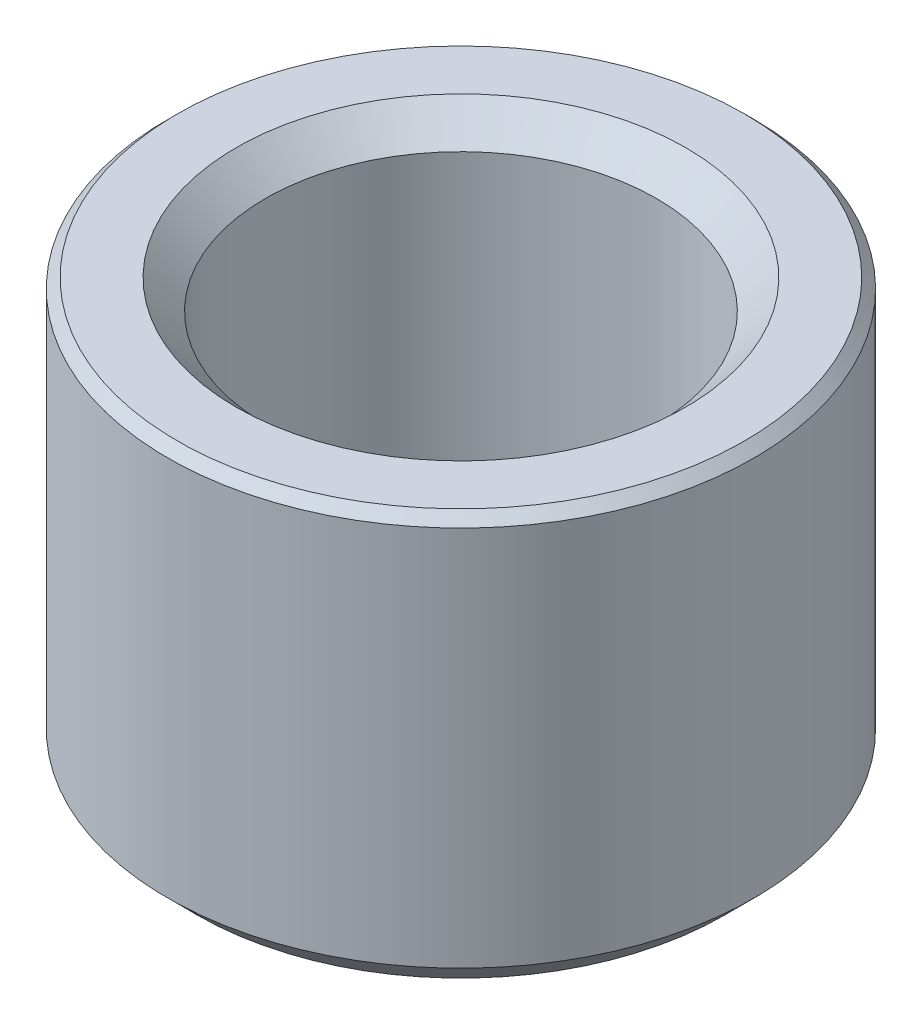
ISO-10303-21;
HEADER;
FILE_DESCRIPTION(('STEP AP214'),'2;1');
FILE_NAME('part.step','',(''),(''),'','','');
FILE_SCHEMA(('AUTOMOTIVE_DESIGN { 1 0 10303 214 1 1 1 1 }'));
ENDSEC;
DATA;
#1=APPLICATION_CONTEXT('core data for automotive mechanical design processes');
#2=APPLICATION_PROTOCOL_DEFINITION('international standard','automotive_design',2000,#1);
#3=PRODUCT_CONTEXT('',#1,'mechanical');
#4=PRODUCT('Part','Part','',(#3));
#5=PRODUCT_RELATED_PRODUCT_CATEGORY('part','',(#4));
#6=PRODUCT_DEFINITION_FORMATION('','',#4);
#7=PRODUCT_DEFINITION_CONTEXT('part definition',#1,'design');
#8=PRODUCT_DEFINITION('design','',#6,#7);
#9=PRODUCT_DEFINITION_SHAPE('','',#8);
#10=(LENGTH_UNIT() NAMED_UNIT(*) SI_UNIT(.MILLI.,.METRE.));
#11=(NAMED_UNIT(*) PLANE_ANGLE_UNIT() SI_UNIT($,.RADIAN.));
#12=(NAMED_UNIT(*) SI_UNIT($,.STERADIAN.) SOLID_ANGLE_UNIT());
#13=UNCERTAINTY_MEASURE_WITH_UNIT(LENGTH_MEASURE(1.E-05),#10,'distance_accuracy_value','');
#14=(GEOMETRIC_REPRESENTATION_CONTEXT(3) GLOBAL_UNCERTAINTY_ASSIGNED_CONTEXT((#13)) GLOBAL_UNIT_ASSIGNED_CONTEXT((#10,
#11,#12)) REPRESENTATION_CONTEXT('',''));
#15=CARTESIAN_POINT('',(0.,0.,0.));
#16=DIRECTION('',(0.,0.,1.));
#17=DIRECTION('',(1.,0.,0.));
#18=AXIS2_PLACEMENT_3D('',#15,#16,#17);
#19=CARTESIAN_POINT('',(0.,0.149999999999999,0.));
#20=DIRECTION('',(0.,1.,0.));
#21=DIRECTION('',(0.,0.,1.));
#22=AXIS2_PLACEMENT_3D('',#19,#20,#21);
#23=CONICAL_SURFACE('',#22,1.5,0.78539816339745);
#24=CARTESIAN_POINT('',(0.,0.,0.));
#25=DIRECTION('',(0.,-1.,0.));
#26=DIRECTION('',(0.,0.,-1.));
#27=AXIS2_PLACEMENT_3D('',#24,#25,#26);
#28=CIRCLE('',#27,1.35);
#29=CARTESIAN_POINT('',(0.,0.,-1.35));
#30=VERTEX_POINT('',#29);
#31=EDGE_CURVE('E10',#30,#30,#28,.T.);
#32=ORIENTED_EDGE('',*,*,#31,.F.);
#33=EDGE_LOOP('',(#32));
#34=FACE_BOUND('',#33,.T.);
#35=CARTESIAN_POINT('',(0.,0.149999999999999,0.));
#36=DIRECTION('',(0.,-1.,0.));
#37=DIRECTION('',(0.,0.,-1.));
#38=AXIS2_PLACEMENT_3D('',#35,#36,#37);
#39=CIRCLE('',#38,1.5);
#40=CARTESIAN_POINT('',(0.,0.149999999999999,-1.5));
#41=VERTEX_POINT('',#40);
#42=EDGE_CURVE('E82',#41,#41,#39,.T.);
#43=ORIENTED_EDGE('',*,*,#42,.T.);
#44=EDGE_LOOP('',(#43));
#45=FACE_BOUND('',#44,.T.);
#46=ADVANCED_FACE('F43',(#34,#45),#23,.T.);
#47=CARTESIAN_POINT('',(-1.35,0.,0.));
#48=DIRECTION('',(0.,1.,0.));
#49=DIRECTION('',(0.,0.,1.));
#50=AXIS2_PLACEMENT_3D('',#47,#48,#49);
#51=PLANE('',#50);
#52=CARTESIAN_POINT('',(0.,0.,0.));
#53=DIRECTION('',(0.,-1.,0.));
#54=DIRECTION('',(0.,0.,-1.));
#55=AXIS2_PLACEMENT_3D('',#52,#53,#54);
#56=CIRCLE('',#55,0.649999999999999);
#57=CARTESIAN_POINT('',(0.,0.,-0.649999999999999));
#58=VERTEX_POINT('',#57);
#59=EDGE_CURVE('E50',#58,#58,#56,.T.);
#60=ORIENTED_EDGE('',*,*,#59,.F.);
#61=EDGE_LOOP('',(#60));
#62=FACE_BOUND('',#61,.T.);
#63=ORIENTED_EDGE('',*,*,#31,.T.);
#64=EDGE_LOOP('',(#63));
#65=FACE_BOUND('',#64,.T.);
#66=ADVANCED_FACE('F126',(#62,#65),#51,.F.);
#67=CARTESIAN_POINT('',(0.,0.,0.));
#68=DIRECTION('',(0.,-1.,0.));
#69=DIRECTION('',(0.,0.,-1.));
#70=AXIS2_PLACEMENT_3D('',#67,#68,#69);
#71=CONICAL_SURFACE('',#70,0.649999999999999,0.785398163397447);
#72=CARTESIAN_POINT('',(0.,0.15,0.));
#73=DIRECTION('',(0.,-1.,0.));
#74=DIRECTION('',(0.,0.,-1.));
#75=AXIS2_PLACEMENT_3D('',#72,#73,#74);
#76=CIRCLE('',#75,0.5);
#77=CARTESIAN_POINT('',(0.,0.15,-0.5));
#78=VERTEX_POINT('',#77);
#79=EDGE_CURVE('E55',#78,#78,#76,.T.);
#80=ORIENTED_EDGE('',*,*,#79,.F.);
#81=EDGE_LOOP('',(#80));
#82=FACE_BOUND('',#81,.T.);
#83=ORIENTED_EDGE('',*,*,#59,.T.);
#84=EDGE_LOOP('',(#83));
#85=FACE_BOUND('',#84,.T.);
#86=ADVANCED_FACE('F121',(#82,#85),#71,.F.);
#87=CARTESIAN_POINT('',(0.,0.15,0.));
#88=DIRECTION('',(0.,1.,0.));
#89=DIRECTION('',(0.,0.,1.));
#90=AXIS2_PLACEMENT_3D('',#87,#88,#89);
#91=CONICAL_SURFACE('',#90,0.5,1.02974425867666);
#92=CARTESIAN_POINT('',(0.,0.450430309513778,0.));
#93=DIRECTION('',(0.,-1.,0.));
#94=DIRECTION('',(0.,0.,-1.));
#95=AXIS2_PLACEMENT_3D('',#92,#93,#94);
#96=CIRCLE('',#95,1.);
#97=CARTESIAN_POINT('',(0.,0.450430309513778,-1.));
#98=VERTEX_POINT('',#97);
#99=EDGE_CURVE('E60',#98,#98,#96,.T.);
#100=ORIENTED_EDGE('',*,*,#99,.F.);
#101=EDGE_LOOP('',(#100));
#102=FACE_BOUND('',#101,.T.);
#103=ORIENTED_EDGE('',*,*,#79,.T.);
#104=EDGE_LOOP('',(#103));
#105=FACE_BOUND('',#104,.T.);
#106=ADVANCED_FACE('F115',(#102,#105),#91,.F.);
#107=CARTESIAN_POINT('',(0.,-0.702737799647969,0.));
#108=DIRECTION('',(0.,-1.,0.));
#109=DIRECTION('',(0.,0.,-1.));
#110=AXIS2_PLACEMENT_3D('',#107,#108,#109);
#111=CYLINDRICAL_SURFACE('',#110,1.);
#112=CARTESIAN_POINT('',(0.,2.,0.));
#113=DIRECTION('',(0.,-1.,0.));
#114=DIRECTION('',(0.,0.,-1.));
#115=AXIS2_PLACEMENT_3D('',#112,#113,#114);
#116=CIRCLE('',#115,1.);
#117=CARTESIAN_POINT('',(0.,2.,-1.));
#118=VERTEX_POINT('',#117);
#119=EDGE_CURVE('E66',#118,#118,#116,.T.);
#120=ORIENTED_EDGE('',*,*,#119,.F.);
#121=EDGE_LOOP('',(#120));
#122=FACE_BOUND('',#121,.T.);
#123=ORIENTED_EDGE('',*,*,#99,.T.);
#124=EDGE_LOOP('',(#123));
#125=FACE_BOUND('',#124,.T.);
#126=ADVANCED_FACE('F109',(#122,#125),#111,.F.);
#127=CARTESIAN_POINT('',(0.,2.,0.));
#128=DIRECTION('',(0.,1.,0.));
#129=DIRECTION('',(0.,0.,1.));
#130=AXIS2_PLACEMENT_3D('',#127,#128,#129);
#131=CONICAL_SURFACE('',#130,1.,0.785398163397453);
#132=CARTESIAN_POINT('',(0.,2.15,0.));
#133=DIRECTION('',(0.,-1.,0.));
#134=DIRECTION('',(0.,0.,-1.));
#135=AXIS2_PLACEMENT_3D('',#132,#133,#134);
#136=CIRCLE('',#135,1.15);
#137=CARTESIAN_POINT('',(0.,2.15,-1.15));
#138=VERTEX_POINT('',#137);
#139=EDGE_CURVE('E70',#138,#138,#136,.T.);
#140=ORIENTED_EDGE('',*,*,#139,.F.);
#141=EDGE_LOOP('',(#140));
#142=FACE_BOUND('',#141,.T.);
#143=ORIENTED_EDGE('',*,*,#119,.T.);
#144=EDGE_LOOP('',(#143));
#145=FACE_BOUND('',#144,.T.);
#146=ADVANCED_FACE('F103',(#142,#145),#131,.F.);
#147=CARTESIAN_POINT('',(-1.15,2.15,0.));
#148=DIRECTION('',(0.,-1.,0.));
#149=DIRECTION('',(0.,0.,-1.));
#150=AXIS2_PLACEMENT_3D('',#147,#148,#149);
#151=PLANE('',#150);
#152=CARTESIAN_POINT('',(0.,2.15,0.));
#153=DIRECTION('',(0.,-1.,0.));
#154=DIRECTION('',(0.,0.,-1.));
#155=AXIS2_PLACEMENT_3D('',#152,#153,#154);
#156=CIRCLE('',#155,1.45);
#157=CARTESIAN_POINT('',(0.,2.15,-1.45));
#158=VERTEX_POINT('',#157);
#159=EDGE_CURVE('E74',#158,#158,#156,.T.);
#160=ORIENTED_EDGE('',*,*,#159,.F.);
#161=EDGE_LOOP('',(#160));
#162=FACE_BOUND('',#161,.T.);
#163=ORIENTED_EDGE('',*,*,#139,.T.);
#164=EDGE_LOOP('',(#163));
#165=FACE_BOUND('',#164,.T.);
#166=ADVANCED_FACE('F97',(#162,#165),#151,.F.);
#167=CARTESIAN_POINT('',(0.,2.15,0.));
#168=DIRECTION('',(0.,-1.,0.));
#169=DIRECTION('',(0.,0.,-1.));
#170=AXIS2_PLACEMENT_3D('',#167,#168,#169);
#171=CONICAL_SURFACE('',#170,1.45,0.78539816339745);
#172=CARTESIAN_POINT('',(0.,2.1,0.));
#173=DIRECTION('',(0.,-1.,0.));
#174=DIRECTION('',(0.,0.,-1.));
#175=AXIS2_PLACEMENT_3D('',#172,#173,#174);
#176=CIRCLE('',#175,1.5);
#177=CARTESIAN_POINT('',(0.,2.1,-1.5));
#178=VERTEX_POINT('',#177);
#179=EDGE_CURVE('E78',#178,#178,#176,.T.);
#180=ORIENTED_EDGE('',*,*,#179,.F.);
#181=EDGE_LOOP('',(#180));
#182=FACE_BOUND('',#181,.T.);
#183=ORIENTED_EDGE('',*,*,#159,.T.);
#184=EDGE_LOOP('',(#183));
#185=FACE_BOUND('',#184,.T.);
#186=ADVANCED_FACE('F91',(#182,#185),#171,.T.);
#187=CARTESIAN_POINT('',(0.,-0.702737799647969,0.));
#188=DIRECTION('',(0.,-1.,0.));
#189=DIRECTION('',(0.,0.,-1.));
#190=AXIS2_PLACEMENT_3D('',#187,#188,#189);
#191=CYLINDRICAL_SURFACE('',#190,1.5);
#192=ORIENTED_EDGE('',*,*,#42,.F.);
#193=EDGE_LOOP('',(#192));
#194=FACE_BOUND('',#193,.T.);
#195=ORIENTED_EDGE('',*,*,#179,.T.);
#196=EDGE_LOOP('',(#195));
#197=FACE_BOUND('',#196,.T.);
#198=ADVANCED_FACE('F88',(#194,#197),#191,.T.);
#199=CLOSED_SHELL('',(#46,#66,#86,#106,#126,#146,#166,#186,#198));
#200=MANIFOLD_SOLID_BREP('B2',#199);
#201=ADVANCED_BREP_SHAPE_REPRESENTATION('',(#18,#200),#14);
#202=SHAPE_DEFINITION_REPRESENTATION(#9,#201);
ENDSEC;
END-ISO-10303-21;
